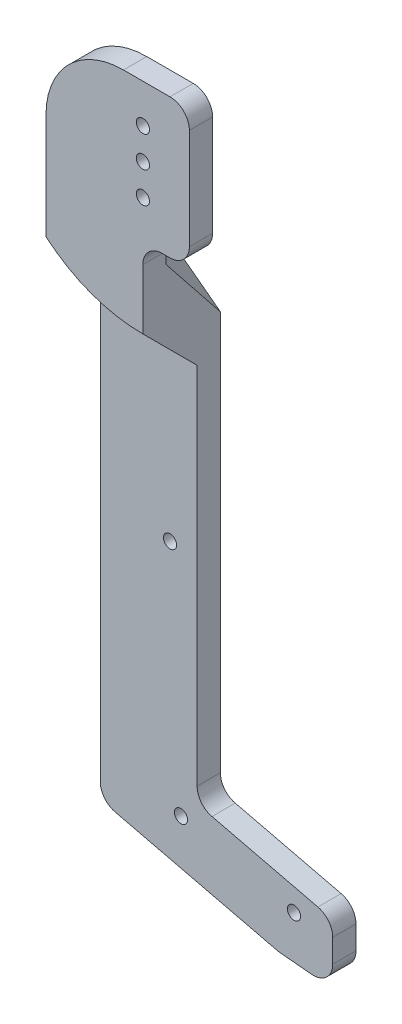
ISO-10303-21;
HEADER;
FILE_DESCRIPTION(('STEP AP214'),'2;1');
FILE_NAME('part.step','',(''),(''),'','','');
FILE_SCHEMA(('AUTOMOTIVE_DESIGN { 1 0 10303 214 1 1 1 1 }'));
ENDSEC;
DATA;
#1=APPLICATION_CONTEXT('core data for automotive mechanical design processes');
#2=APPLICATION_PROTOCOL_DEFINITION('international standard','automotive_design',2000,#1);
#3=PRODUCT_CONTEXT('',#1,'mechanical');
#4=PRODUCT('Part','Part','',(#3));
#5=PRODUCT_RELATED_PRODUCT_CATEGORY('part','',(#4));
#6=PRODUCT_DEFINITION_FORMATION('','',#4);
#7=PRODUCT_DEFINITION_CONTEXT('part definition',#1,'design');
#8=PRODUCT_DEFINITION('design','',#6,#7);
#9=PRODUCT_DEFINITION_SHAPE('','',#8);
#10=(LENGTH_UNIT() NAMED_UNIT(*) SI_UNIT(.MILLI.,.METRE.));
#11=(NAMED_UNIT(*) PLANE_ANGLE_UNIT() SI_UNIT($,.RADIAN.));
#12=(NAMED_UNIT(*) SI_UNIT($,.STERADIAN.) SOLID_ANGLE_UNIT());
#13=UNCERTAINTY_MEASURE_WITH_UNIT(LENGTH_MEASURE(1.E-05),#10,'distance_accuracy_value','');
#14=(GEOMETRIC_REPRESENTATION_CONTEXT(3) GLOBAL_UNCERTAINTY_ASSIGNED_CONTEXT((#13)) GLOBAL_UNIT_ASSIGNED_CONTEXT((#10,
#11,#12)) REPRESENTATION_CONTEXT('',''));
#15=CARTESIAN_POINT('',(0.,0.,0.));
#16=DIRECTION('',(0.,0.,1.));
#17=DIRECTION('',(1.,0.,0.));
#18=AXIS2_PLACEMENT_3D('',#15,#16,#17);
#19=CARTESIAN_POINT('',(-91.8,168.343206378851,20.));
#20=DIRECTION('',(0.,0.,-1.));
#21=DIRECTION('',(1.,0.,0.));
#22=AXIS2_PLACEMENT_3D('',#19,#20,#21);
#23=PLANE('',#22);
#24=CARTESIAN_POINT('',(-91.8,176.343206378851,20.));
#25=DIRECTION('',(0.,0.,1.));
#26=DIRECTION('',(1.,0.,0.));
#27=AXIS2_PLACEMENT_3D('',#24,#25,#26);
#28=CIRCLE('',#27,1.70000000000001);
#29=CARTESIAN_POINT('',(-90.1,176.343206378851,20.));
#30=VERTEX_POINT('',#29);
#31=EDGE_CURVE('E210',#30,#30,#28,.T.);
#32=ORIENTED_EDGE('',*,*,#31,.T.);
#33=EDGE_LOOP('',(#32));
#34=FACE_BOUND('',#33,.T.);
#35=CARTESIAN_POINT('',(-91.8,168.343206378851,20.));
#36=DIRECTION('',(0.,0.,1.));
#37=DIRECTION('',(1.,0.,0.));
#38=AXIS2_PLACEMENT_3D('',#35,#36,#37);
#39=CIRCLE('',#38,1.70000000000001);
#40=CARTESIAN_POINT('',(-90.1,168.343206378851,20.));
#41=VERTEX_POINT('',#40);
#42=EDGE_CURVE('E544',#41,#41,#39,.T.);
#43=ORIENTED_EDGE('',*,*,#42,.T.);
#44=EDGE_LOOP('',(#43));
#45=FACE_BOUND('',#44,.T.);
#46=CARTESIAN_POINT('',(-91.8,160.343206378851,20.));
#47=DIRECTION('',(0.,0.,1.));
#48=DIRECTION('',(1.,0.,0.));
#49=AXIS2_PLACEMENT_3D('',#46,#47,#48);
#50=CIRCLE('',#49,1.70000000000001);
#51=CARTESIAN_POINT('',(-90.0999999999999,160.343206378851,20.));
#52=VERTEX_POINT('',#51);
#53=EDGE_CURVE('E541',#52,#52,#50,.T.);
#54=ORIENTED_EDGE('',*,*,#53,.T.);
#55=EDGE_LOOP('',(#54));
#56=FACE_BOUND('',#55,.T.);
#57=DIRECTION('',(0.,1.,0.));
#58=VECTOR('',#57,1.);
#59=CARTESIAN_POINT('',(-116.8,0.,20.));
#60=LINE('',#59,#58);
#61=CARTESIAN_POINT('',(-116.8,161.201777950308,20.));
#62=VERTEX_POINT('',#61);
#63=CARTESIAN_POINT('',(-116.8,166.343206378851,20.));
#64=VERTEX_POINT('',#63);
#65=EDGE_CURVE('E206',#62,#64,#60,.T.);
#66=ORIENTED_EDGE('',*,*,#65,.T.);
#67=CARTESIAN_POINT('',(-96.8,166.343206378851,20.));
#68=DIRECTION('',(0.,0.,1.));
#69=DIRECTION('',(1.,0.,0.));
#70=AXIS2_PLACEMENT_3D('',#67,#68,#69);
#71=CIRCLE('',#70,20.);
#72=CARTESIAN_POINT('',(-96.8,186.343206378851,20.));
#73=VERTEX_POINT('',#72);
#74=EDGE_CURVE('E223',#64,#73,#71,.F.);
#75=ORIENTED_EDGE('',*,*,#74,.T.);
#76=DIRECTION('',(-1.,0.,0.));
#77=VECTOR('',#76,1.);
#78=CARTESIAN_POINT('',(0.,186.343206378851,20.));
#79=LINE('',#78,#77);
#80=CARTESIAN_POINT('',(-84.8,186.343206378851,20.));
#81=VERTEX_POINT('',#80);
#82=EDGE_CURVE('E539',#81,#73,#79,.T.);
#83=ORIENTED_EDGE('',*,*,#82,.F.);
#84=CARTESIAN_POINT('',(-84.8,181.343206378851,20.));
#85=DIRECTION('',(0.,0.,1.));
#86=DIRECTION('',(1.,0.,0.));
#87=AXIS2_PLACEMENT_3D('',#84,#85,#86);
#88=CIRCLE('',#87,5.);
#89=CARTESIAN_POINT('',(-79.8,181.343206378851,20.));
#90=VERTEX_POINT('',#89);
#91=EDGE_CURVE('E329',#81,#90,#88,.F.);
#92=ORIENTED_EDGE('',*,*,#91,.T.);
#93=DIRECTION('',(0.,-1.,0.));
#94=VECTOR('',#93,1.);
#95=CARTESIAN_POINT('',(-79.8,0.,20.));
#96=LINE('',#95,#94);
#97=CARTESIAN_POINT('',(-79.8,155.343206378851,20.));
#98=VERTEX_POINT('',#97);
#99=EDGE_CURVE('E534',#90,#98,#96,.T.);
#100=ORIENTED_EDGE('',*,*,#99,.T.);
#101=CARTESIAN_POINT('',(-84.8,155.343206378851,20.));
#102=DIRECTION('',(0.,0.,1.));
#103=DIRECTION('',(1.,0.,0.));
#104=AXIS2_PLACEMENT_3D('',#101,#102,#103);
#105=CIRCLE('',#104,5.);
#106=CARTESIAN_POINT('',(-84.8,150.343206378851,20.));
#107=VERTEX_POINT('',#106);
#108=EDGE_CURVE('E533',#98,#107,#105,.F.);
#109=ORIENTED_EDGE('',*,*,#108,.T.);
#110=DIRECTION('',(1.,0.,0.));
#111=VECTOR('',#110,1.);
#112=CARTESIAN_POINT('',(0.,150.343206378851,20.));
#113=LINE('',#112,#111);
#114=CARTESIAN_POINT('',(-86.8,150.343206378851,20.));
#115=VERTEX_POINT('',#114);
#116=EDGE_CURVE('E218',#115,#107,#113,.T.);
#117=ORIENTED_EDGE('',*,*,#116,.F.);
#118=CARTESIAN_POINT('',(-86.8,145.343206378851,20.));
#119=DIRECTION('',(0.,0.,1.));
#120=DIRECTION('',(1.,0.,0.));
#121=AXIS2_PLACEMENT_3D('',#118,#119,#120);
#122=CIRCLE('',#121,5.);
#123=CARTESIAN_POINT('',(-91.8,145.343206378851,20.));
#124=VERTEX_POINT('',#123);
#125=EDGE_CURVE('E217',#124,#115,#122,.F.);
#126=ORIENTED_EDGE('',*,*,#125,.F.);
#127=DIRECTION('',(0.,-1.,0.));
#128=VECTOR('',#127,1.);
#129=CARTESIAN_POINT('',(-91.8,0.,20.));
#130=LINE('',#129,#128);
#131=CARTESIAN_POINT('',(-91.8,142.343206378851,20.));
#132=VERTEX_POINT('',#131);
#133=EDGE_CURVE('E209',#124,#132,#130,.T.);
#134=ORIENTED_EDGE('',*,*,#133,.T.);
#135=DIRECTION('',(-0.79833273895498,0.602216603816799,0.));
#136=VECTOR('',#135,1.);
#137=CARTESIAN_POINT('',(35.1416017156057,46.5857151248841,20.));
#138=LINE('',#137,#136);
#139=EDGE_CURVE('E194',#132,#62,#138,.T.);
#140=ORIENTED_EDGE('',*,*,#139,.T.);
#141=EDGE_LOOP('',(#66,#75,#83,#92,#100,#109,#117,#126,#134,#140));
#142=FACE_BOUND('',#141,.T.);
#143=ADVANCED_FACE('F41',(#34,#45,#56,#142),#23,.T.);
#144=CARTESIAN_POINT('',(-79.8,0.,6.));
#145=DIRECTION('',(1.,0.,0.));
#146=DIRECTION('',(0.,0.,1.));
#147=AXIS2_PLACEMENT_3D('',#144,#145,#146);
#148=PLANE('',#147);
#149=DIRECTION('',(0.,0.,1.));
#150=VECTOR('',#149,1.);
#151=CARTESIAN_POINT('',(-79.8,181.343206378851,6.));
#152=LINE('',#151,#150);
#153=CARTESIAN_POINT('',(-79.8,181.343206378851,26.));
#154=VERTEX_POINT('',#153);
#155=EDGE_CURVE('E321',#154,#90,#152,.F.);
#156=ORIENTED_EDGE('',*,*,#155,.F.);
#157=DIRECTION('',(0.,1.,0.));
#158=VECTOR('',#157,1.);
#159=CARTESIAN_POINT('',(-79.8,0.,26.));
#160=LINE('',#159,#158);
#161=CARTESIAN_POINT('',(-79.8,155.343206378851,26.));
#162=VERTEX_POINT('',#161);
#163=EDGE_CURVE('E249',#162,#154,#160,.T.);
#164=ORIENTED_EDGE('',*,*,#163,.F.);
#165=DIRECTION('',(0.,0.,1.));
#166=VECTOR('',#165,1.);
#167=CARTESIAN_POINT('',(-79.8,155.343206378851,12.));
#168=LINE('',#167,#166);
#169=EDGE_CURVE('E323',#98,#162,#168,.T.);
#170=ORIENTED_EDGE('',*,*,#169,.F.);
#171=ORIENTED_EDGE('',*,*,#99,.F.);
#172=EDGE_LOOP('',(#156,#164,#170,#171));
#173=FACE_BOUND('',#172,.T.);
#174=ADVANCED_FACE('F380',(#173),#148,.T.);
#175=CARTESIAN_POINT('',(0.,186.343206378851,6.));
#176=DIRECTION('',(0.,-1.,0.));
#177=DIRECTION('',(0.,0.,1.));
#178=AXIS2_PLACEMENT_3D('',#175,#176,#177);
#179=PLANE('',#178);
#180=ORIENTED_EDGE('',*,*,#82,.T.);
#181=DIRECTION('',(0.,0.,1.));
#182=VECTOR('',#181,1.);
#183=CARTESIAN_POINT('',(-96.8,186.343206378851,6.));
#184=LINE('',#183,#182);
#185=CARTESIAN_POINT('',(-96.8,186.343206378851,26.));
#186=VERTEX_POINT('',#185);
#187=EDGE_CURVE('E312',#186,#73,#184,.F.);
#188=ORIENTED_EDGE('',*,*,#187,.F.);
#189=DIRECTION('',(-1.,0.,0.));
#190=VECTOR('',#189,1.);
#191=CARTESIAN_POINT('',(0.,186.343206378851,26.));
#192=LINE('',#191,#190);
#193=CARTESIAN_POINT('',(-84.8,186.343206378851,26.));
#194=VERTEX_POINT('',#193);
#195=EDGE_CURVE('E254',#194,#186,#192,.T.);
#196=ORIENTED_EDGE('',*,*,#195,.F.);
#197=DIRECTION('',(0.,0.,1.));
#198=VECTOR('',#197,1.);
#199=CARTESIAN_POINT('',(-84.8,186.343206378851,12.));
#200=LINE('',#199,#198);
#201=EDGE_CURVE('E326',#81,#194,#200,.T.);
#202=ORIENTED_EDGE('',*,*,#201,.F.);
#203=EDGE_LOOP('',(#180,#188,#196,#202));
#204=FACE_BOUND('',#203,.T.);
#205=ADVANCED_FACE('F386',(#204),#179,.F.);
#206=CARTESIAN_POINT('',(-91.8,160.343206378851,6.));
#207=DIRECTION('',(0.,0.,1.));
#208=DIRECTION('',(-1.,0.,0.));
#209=AXIS2_PLACEMENT_3D('',#206,#207,#208);
#210=CYLINDRICAL_SURFACE('',#209,1.70000000000001);
#211=CARTESIAN_POINT('',(-91.8,160.343206378851,26.));
#212=DIRECTION('',(0.,0.,1.));
#213=DIRECTION('',(1.,0.,0.));
#214=AXIS2_PLACEMENT_3D('',#211,#212,#213);
#215=CIRCLE('',#214,1.70000000000001);
#216=CARTESIAN_POINT('',(-90.0999999999999,160.343206378851,26.));
#217=VERTEX_POINT('',#216);
#218=EDGE_CURVE('E231',#217,#217,#215,.F.);
#219=ORIENTED_EDGE('',*,*,#218,.F.);
#220=EDGE_LOOP('',(#219));
#221=FACE_BOUND('',#220,.T.);
#222=ORIENTED_EDGE('',*,*,#53,.F.);
#223=EDGE_LOOP('',(#222));
#224=FACE_BOUND('',#223,.T.);
#225=ADVANCED_FACE('F415',(#221,#224),#210,.F.);
#226=CARTESIAN_POINT('',(-91.8,168.343206378851,6.));
#227=DIRECTION('',(0.,0.,1.));
#228=DIRECTION('',(-1.,0.,0.));
#229=AXIS2_PLACEMENT_3D('',#226,#227,#228);
#230=CYLINDRICAL_SURFACE('',#229,1.70000000000001);
#231=CARTESIAN_POINT('',(-91.8,168.343206378851,26.));
#232=DIRECTION('',(0.,0.,1.));
#233=DIRECTION('',(1.,0.,0.));
#234=AXIS2_PLACEMENT_3D('',#231,#232,#233);
#235=CIRCLE('',#234,1.70000000000001);
#236=CARTESIAN_POINT('',(-90.1,168.343206378851,26.));
#237=VERTEX_POINT('',#236);
#238=EDGE_CURVE('E228',#237,#237,#235,.F.);
#239=ORIENTED_EDGE('',*,*,#238,.F.);
#240=EDGE_LOOP('',(#239));
#241=FACE_BOUND('',#240,.T.);
#242=ORIENTED_EDGE('',*,*,#42,.F.);
#243=EDGE_LOOP('',(#242));
#244=FACE_BOUND('',#243,.T.);
#245=ADVANCED_FACE('F418',(#241,#244),#230,.F.);
#246=CARTESIAN_POINT('',(-91.8,176.343206378851,6.));
#247=DIRECTION('',(0.,0.,1.));
#248=DIRECTION('',(-1.,0.,0.));
#249=AXIS2_PLACEMENT_3D('',#246,#247,#248);
#250=CYLINDRICAL_SURFACE('',#249,1.70000000000001);
#251=CARTESIAN_POINT('',(-91.8,176.343206378851,26.));
#252=DIRECTION('',(0.,0.,1.));
#253=DIRECTION('',(1.,0.,0.));
#254=AXIS2_PLACEMENT_3D('',#251,#252,#253);
#255=CIRCLE('',#254,1.70000000000001);
#256=CARTESIAN_POINT('',(-90.1,176.343206378851,26.));
#257=VERTEX_POINT('',#256);
#258=EDGE_CURVE('E234',#257,#257,#255,.F.);
#259=ORIENTED_EDGE('',*,*,#258,.F.);
#260=EDGE_LOOP('',(#259));
#261=FACE_BOUND('',#260,.T.);
#262=ORIENTED_EDGE('',*,*,#31,.F.);
#263=EDGE_LOOP('',(#262));
#264=FACE_BOUND('',#263,.T.);
#265=ADVANCED_FACE('F422',(#261,#264),#250,.F.);
#266=CARTESIAN_POINT('',(0.,150.343206378851,6.));
#267=DIRECTION('',(0.,1.,0.));
#268=DIRECTION('',(0.,0.,-1.));
#269=AXIS2_PLACEMENT_3D('',#266,#267,#268);
#270=PLANE('',#269);
#271=ORIENTED_EDGE('',*,*,#116,.T.);
#272=DIRECTION('',(0.,0.,1.));
#273=VECTOR('',#272,1.);
#274=CARTESIAN_POINT('',(-84.8,150.343206378851,6.));
#275=LINE('',#274,#273);
#276=CARTESIAN_POINT('',(-84.8,150.343206378851,26.));
#277=VERTEX_POINT('',#276);
#278=EDGE_CURVE('E314',#277,#107,#275,.F.);
#279=ORIENTED_EDGE('',*,*,#278,.F.);
#280=DIRECTION('',(1.,0.,0.));
#281=VECTOR('',#280,1.);
#282=CARTESIAN_POINT('',(0.,150.343206378851,26.));
#283=LINE('',#282,#281);
#284=CARTESIAN_POINT('',(-86.8,150.343206378851,26.));
#285=VERTEX_POINT('',#284);
#286=EDGE_CURVE('E244',#285,#277,#283,.T.);
#287=ORIENTED_EDGE('',*,*,#286,.F.);
#288=DIRECTION('',(0.,0.,1.));
#289=VECTOR('',#288,1.);
#290=CARTESIAN_POINT('',(-86.8,150.343206378851,6.));
#291=LINE('',#290,#289);
#292=EDGE_CURVE('E316',#115,#285,#291,.T.);
#293=ORIENTED_EDGE('',*,*,#292,.F.);
#294=EDGE_LOOP('',(#271,#279,#287,#293));
#295=FACE_BOUND('',#294,.T.);
#296=ADVANCED_FACE('F426',(#295),#270,.F.);
#297=CARTESIAN_POINT('',(-96.8,166.343206378851,6.));
#298=DIRECTION('',(0.,0.,-1.));
#299=DIRECTION('',(1.,0.,0.));
#300=AXIS2_PLACEMENT_3D('',#297,#298,#299);
#301=CYLINDRICAL_SURFACE('',#300,20.);
#302=DIRECTION('',(0.,0.,1.));
#303=VECTOR('',#302,1.);
#304=CARTESIAN_POINT('',(-116.8,166.343206378851,12.));
#305=LINE('',#304,#303);
#306=CARTESIAN_POINT('',(-116.8,166.343206378851,26.));
#307=VERTEX_POINT('',#306);
#308=EDGE_CURVE('E215',#64,#307,#305,.T.);
#309=ORIENTED_EDGE('',*,*,#308,.T.);
#310=CARTESIAN_POINT('',(-96.8,166.343206378851,26.));
#311=DIRECTION('',(0.,0.,1.));
#312=DIRECTION('',(1.,0.,0.));
#313=AXIS2_PLACEMENT_3D('',#310,#311,#312);
#314=CIRCLE('',#313,20.);
#315=EDGE_CURVE('E257',#186,#307,#314,.T.);
#316=ORIENTED_EDGE('',*,*,#315,.F.);
#317=ORIENTED_EDGE('',*,*,#187,.T.);
#318=ORIENTED_EDGE('',*,*,#74,.F.);
#319=EDGE_LOOP('',(#309,#316,#317,#318));
#320=FACE_BOUND('',#319,.T.);
#321=ADVANCED_FACE('F430',(#320),#301,.T.);
#322=CARTESIAN_POINT('',(-86.8,145.343206378851,6.));
#323=DIRECTION('',(0.,0.,1.));
#324=DIRECTION('',(-1.,0.,0.));
#325=AXIS2_PLACEMENT_3D('',#322,#323,#324);
#326=CYLINDRICAL_SURFACE('',#325,5.);
#327=ORIENTED_EDGE('',*,*,#125,.T.);
#328=ORIENTED_EDGE('',*,*,#292,.T.);
#329=CARTESIAN_POINT('',(-86.8,145.343206378851,26.));
#330=DIRECTION('',(0.,0.,1.));
#331=DIRECTION('',(1.,0.,0.));
#332=AXIS2_PLACEMENT_3D('',#329,#330,#331);
#333=CIRCLE('',#332,5.);
#334=CARTESIAN_POINT('',(-91.8,145.343206378851,26.));
#335=VERTEX_POINT('',#334);
#336=EDGE_CURVE('E242',#335,#285,#333,.F.);
#337=ORIENTED_EDGE('',*,*,#336,.F.);
#338=DIRECTION('',(0.,0.,1.));
#339=VECTOR('',#338,1.);
#340=CARTESIAN_POINT('',(-91.8,145.343206378851,6.));
#341=LINE('',#340,#339);
#342=EDGE_CURVE('E319',#335,#124,#341,.F.);
#343=ORIENTED_EDGE('',*,*,#342,.T.);
#344=EDGE_LOOP('',(#327,#328,#337,#343));
#345=FACE_BOUND('',#344,.T.);
#346=ADVANCED_FACE('F524',(#345),#326,.F.);
#347=CARTESIAN_POINT('',(-84.8,155.343206378851,6.));
#348=DIRECTION('',(0.,0.,-1.));
#349=DIRECTION('',(1.,0.,0.));
#350=AXIS2_PLACEMENT_3D('',#347,#348,#349);
#351=CYLINDRICAL_SURFACE('',#350,5.);
#352=ORIENTED_EDGE('',*,*,#169,.T.);
#353=CARTESIAN_POINT('',(-84.8,155.343206378851,26.));
#354=DIRECTION('',(0.,0.,1.));
#355=DIRECTION('',(1.,0.,0.));
#356=AXIS2_PLACEMENT_3D('',#353,#354,#355);
#357=CIRCLE('',#356,5.);
#358=EDGE_CURVE('E247',#277,#162,#357,.T.);
#359=ORIENTED_EDGE('',*,*,#358,.F.);
#360=ORIENTED_EDGE('',*,*,#278,.T.);
#361=ORIENTED_EDGE('',*,*,#108,.F.);
#362=EDGE_LOOP('',(#352,#359,#360,#361));
#363=FACE_BOUND('',#362,.T.);
#364=ADVANCED_FACE('F562',(#363),#351,.T.);
#365=CARTESIAN_POINT('',(-84.8,181.343206378851,6.));
#366=DIRECTION('',(0.,0.,-1.));
#367=DIRECTION('',(1.,0.,0.));
#368=AXIS2_PLACEMENT_3D('',#365,#366,#367);
#369=CYLINDRICAL_SURFACE('',#368,5.);
#370=ORIENTED_EDGE('',*,*,#201,.T.);
#371=CARTESIAN_POINT('',(-84.8,181.343206378851,26.));
#372=DIRECTION('',(0.,0.,1.));
#373=DIRECTION('',(1.,0.,0.));
#374=AXIS2_PLACEMENT_3D('',#371,#372,#373);
#375=CIRCLE('',#374,5.);
#376=EDGE_CURVE('E252',#154,#194,#375,.T.);
#377=ORIENTED_EDGE('',*,*,#376,.F.);
#378=ORIENTED_EDGE('',*,*,#155,.T.);
#379=ORIENTED_EDGE('',*,*,#91,.F.);
#380=EDGE_LOOP('',(#370,#377,#378,#379));
#381=FACE_BOUND('',#380,.T.);
#382=ADVANCED_FACE('F358',(#381),#369,.T.);
#383=CARTESIAN_POINT('',(-116.8,0.,6.));
#384=DIRECTION('',(-1.,0.,0.));
#385=DIRECTION('',(0.,0.,-1.));
#386=AXIS2_PLACEMENT_3D('',#383,#384,#385);
#387=PLANE('',#386);
#388=DIRECTION('',(0.,1.,0.));
#389=VECTOR('',#388,1.);
#390=CARTESIAN_POINT('',(-116.8,0.,12.));
#391=LINE('',#390,#389);
#392=CARTESIAN_POINT('',(-116.8,10.2851904317238,12.));
#393=VERTEX_POINT('',#392);
#394=CARTESIAN_POINT('',(-116.8,122.177743097302,12.));
#395=VERTEX_POINT('',#394);
#396=EDGE_CURVE('E260',#393,#395,#391,.T.);
#397=ORIENTED_EDGE('',*,*,#396,.T.);
#398=CARTESIAN_POINT('',(-116.8,139.064374434936,26.));
#399=CARTESIAN_POINT('',(-116.8,138.700457591178,25.7232404987831));
#400=CARTESIAN_POINT('',(-116.8,138.337586577493,25.4451105847748));
#401=CARTESIAN_POINT('',(-116.8,137.613800612838,24.8863230709105));
#402=CARTESIAN_POINT('',(-116.8,137.252885645053,24.6056654928386));
#403=CARTESIAN_POINT('',(-116.8,136.172896898765,23.7602410622729));
#404=CARTESIAN_POINT('',(-116.8,135.456544074135,23.191995680082));
#405=CARTESIAN_POINT('',(-116.8,134.030375744549,22.0477998598504));
#406=CARTESIAN_POINT('',(-116.8,133.32055838123,21.4718517339912));
#407=CARTESIAN_POINT('',(-116.8,131.906446473543,20.3132012796707));
#408=CARTESIAN_POINT('',(-116.8,131.202152000253,19.7304988645201));
#409=CARTESIAN_POINT('',(-116.8,129.79852480176,18.5593549160808));
#410=CARTESIAN_POINT('',(-116.8,129.099191385901,17.970914209854));
#411=CARTESIAN_POINT('',(-116.8,127.704816864184,16.7889746382706));
#412=CARTESIAN_POINT('',(-116.8,127.009775750277,16.1954757824045));
#413=CARTESIAN_POINT('',(-116.8,125.623284992167,15.0038801251373));
#414=CARTESIAN_POINT('',(-116.8,124.931836492278,14.4057819931989));
#415=CARTESIAN_POINT('',(-116.8,123.552341574005,13.2056870748378));
#416=CARTESIAN_POINT('',(-116.8,122.864295124071,12.603690324691));
#417=CARTESIAN_POINT('',(-116.8,122.177743097302,12.));
#418=B_SPLINE_CURVE_WITH_KNOTS('',3,(#398,#399,#400,#401,#402,#403,#404,#405,#406,#407,#408,
#409,#410,#411,#412,#413,#414,#415,#416,#417),.UNSPECIFIED.,.F.,.F.,(4,2,2,2,2,2,2,2,2,4),(0.,
1.37159023815598,2.74316866692933,5.48619274357092,8.22841112922936,10.9706647495671,
13.7125288039228,16.4543877149276,19.197072137035,21.9397310754558),.UNSPECIFIED.);
#419=CARTESIAN_POINT('',(-116.8,139.064374434936,26.));
#420=VERTEX_POINT('',#419);
#421=EDGE_CURVE('E339',#420,#395,#418,.T.);
#422=ORIENTED_EDGE('',*,*,#421,.F.);
#423=DIRECTION('',(0.,-1.,0.));
#424=VECTOR('',#423,1.);
#425=CARTESIAN_POINT('',(-116.8,0.,26.));
#426=LINE('',#425,#424);
#427=EDGE_CURVE('E237',#307,#420,#426,.T.);
#428=ORIENTED_EDGE('',*,*,#427,.F.);
#429=ORIENTED_EDGE('',*,*,#308,.F.);
#430=ORIENTED_EDGE('',*,*,#65,.F.);
#431=DIRECTION('',(0.,0.781504000960084,0.623900229590742));
#432=VECTOR('',#431,1.);
#433=CARTESIAN_POINT('',(-116.8,55.9219059441879,-64.0483685754759));
#434=LINE('',#433,#432);
#435=CARTESIAN_POINT('',(-116.8,143.665230447163,6.));
#436=VERTEX_POINT('',#435);
#437=EDGE_CURVE('E190',#436,#62,#434,.T.);
#438=ORIENTED_EDGE('',*,*,#437,.F.);
#439=DIRECTION('',(0.,1.,0.));
#440=VECTOR('',#439,1.);
#441=CARTESIAN_POINT('',(-116.8,0.,6.));
#442=LINE('',#441,#440);
#443=CARTESIAN_POINT('',(-116.8,10.2851904317238,6.));
#444=VERTEX_POINT('',#443);
#445=EDGE_CURVE('E261',#444,#436,#442,.T.);
#446=ORIENTED_EDGE('',*,*,#445,.F.);
#447=DIRECTION('',(0.,0.,1.));
#448=VECTOR('',#447,1.);
#449=CARTESIAN_POINT('',(-116.8,10.2851904317238,6.));
#450=LINE('',#449,#448);
#451=EDGE_CURVE('E472',#393,#444,#450,.F.);
#452=ORIENTED_EDGE('',*,*,#451,.F.);
#453=EDGE_LOOP('',(#397,#422,#428,#429,#430,#438,#446,#452));
#454=FACE_BOUND('',#453,.T.);
#455=ADVANCED_FACE('F213',(#454),#387,.T.);
#456=CARTESIAN_POINT('',(-4.92181398361935,-20.5075582650806,6.));
#457=DIRECTION('',(-0.233372952475324,-0.972387301980517,0.));
#458=DIRECTION('',(0.972387301980517,-0.233372952475325,0.));
#459=AXIS2_PLACEMENT_3D('',#456,#457,#458);
#460=PLANE('',#459);
#461=DIRECTION('',(-0.972387301980517,0.233372952475325,0.));
#462=VECTOR('',#461,1.);
#463=CARTESIAN_POINT('',(-4.92181398361935,-20.5075582650806,12.));
#464=LINE('',#463,#462);
#465=CARTESIAN_POINT('',(-71.1017199813971,-4.62438082561388,12.));
#466=VERTEX_POINT('',#465);
#467=CARTESIAN_POINT('',(-112.966864762377,5.42325392182121,12.));
#468=VERTEX_POINT('',#467);
#469=EDGE_CURVE('E288',#466,#468,#464,.T.);
#470=ORIENTED_EDGE('',*,*,#469,.T.);
#471=DIRECTION('',(0.,0.,1.));
#472=VECTOR('',#471,1.);
#473=CARTESIAN_POINT('',(-112.966864762377,5.42325392182121,6.));
#474=LINE('',#473,#472);
#475=CARTESIAN_POINT('',(-112.966864762377,5.42325392182121,6.));
#476=VERTEX_POINT('',#475);
#477=EDGE_CURVE('E457',#476,#468,#474,.T.);
#478=ORIENTED_EDGE('',*,*,#477,.F.);
#479=DIRECTION('',(-0.972387301980517,0.233372952475325,0.));
#480=VECTOR('',#479,1.);
#481=CARTESIAN_POINT('',(-4.92181398361935,-20.5075582650806,6.));
#482=LINE('',#481,#480);
#483=CARTESIAN_POINT('',(-71.1017199813971,-4.62438082561388,6.));
#484=VERTEX_POINT('',#483);
#485=EDGE_CURVE('E263',#484,#476,#482,.T.);
#486=ORIENTED_EDGE('',*,*,#485,.F.);
#487=DIRECTION('',(0.,0.,1.));
#488=VECTOR('',#487,1.);
#489=CARTESIAN_POINT('',(-71.1017199813971,-4.62438082561389,6.));
#490=LINE('',#489,#488);
#491=EDGE_CURVE('E458',#466,#484,#490,.F.);
#492=ORIENTED_EDGE('',*,*,#491,.F.);
#493=EDGE_LOOP('',(#470,#478,#486,#492));
#494=FACE_BOUND('',#493,.T.);
#495=ADVANCED_FACE('F445',(#494),#460,.T.);
#496=CARTESIAN_POINT('',(-1.03363541910885,-11.1634606403012,6.));
#497=DIRECTION('',(-0.092196588260455,-0.995740824267606,0.));
#498=DIRECTION('',(0.995740824267606,-0.092196588260455,0.));
#499=AXIS2_PLACEMENT_3D('',#496,#497,#498);
#500=PLANE('',#499);
#501=DIRECTION('',(-0.995740824267606,0.092196588260455,0.));
#502=VECTOR('',#501,1.);
#503=CARTESIAN_POINT('',(-1.03363541910885,-11.1634606403012,12.));
#504=LINE('',#503,#502);
#505=CARTESIAN_POINT('',(-62.2609829413023,-5.4943624048889,12.));
#506=VERTEX_POINT('',#505);
#507=CARTESIAN_POINT('',(-70.3958381603228,-4.74114843704933,12.));
#508=VERTEX_POINT('',#507);
#509=EDGE_CURVE('E291',#506,#508,#504,.T.);
#510=ORIENTED_EDGE('',*,*,#509,.T.);
#511=DIRECTION('',(0.,0.,1.));
#512=VECTOR('',#511,1.);
#513=CARTESIAN_POINT('',(-70.3958381603228,-4.74114843704933,6.));
#514=LINE('',#513,#512);
#515=CARTESIAN_POINT('',(-70.3958381603228,-4.74114843704933,6.));
#516=VERTEX_POINT('',#515);
#517=EDGE_CURVE('E474',#516,#508,#514,.T.);
#518=ORIENTED_EDGE('',*,*,#517,.F.);
#519=DIRECTION('',(-0.995740824267606,0.092196588260455,0.));
#520=VECTOR('',#519,1.);
#521=CARTESIAN_POINT('',(-1.03363541910885,-11.1634606403012,6.));
#522=LINE('',#521,#520);
#523=CARTESIAN_POINT('',(-62.2609829413023,-5.4943624048889,6.));
#524=VERTEX_POINT('',#523);
#525=EDGE_CURVE('E267',#524,#516,#522,.T.);
#526=ORIENTED_EDGE('',*,*,#525,.F.);
#527=DIRECTION('',(0.,0.,1.));
#528=VECTOR('',#527,1.);
#529=CARTESIAN_POINT('',(-62.2609829413023,-5.4943624048889,6.));
#530=LINE('',#529,#528);
#531=EDGE_CURVE('E470',#506,#524,#530,.F.);
#532=ORIENTED_EDGE('',*,*,#531,.F.);
#533=EDGE_LOOP('',(#510,#518,#526,#532));
#534=FACE_BOUND('',#533,.T.);
#535=ADVANCED_FACE('F442',(#534),#500,.T.);
#536=CARTESIAN_POINT('',(-56.8,0.,6.));
#537=DIRECTION('',(-1.,0.,0.));
#538=DIRECTION('',(0.,-1.,0.));
#539=AXIS2_PLACEMENT_3D('',#536,#537,#538);
#540=PLANE('',#539);
#541=DIRECTION('',(0.,1.,0.));
#542=VECTOR('',#541,1.);
#543=CARTESIAN_POINT('',(-56.8,0.,12.));
#544=LINE('',#543,#542);
#545=CARTESIAN_POINT('',(-56.8,-0.515658283550868,12.));
#546=VERTEX_POINT('',#545);
#547=CARTESIAN_POINT('',(-56.8,5.48396810574596,12.));
#548=VERTEX_POINT('',#547);
#549=EDGE_CURVE('E294',#546,#548,#544,.T.);
#550=ORIENTED_EDGE('',*,*,#549,.F.);
#551=DIRECTION('',(0.,0.,1.));
#552=VECTOR('',#551,1.);
#553=CARTESIAN_POINT('',(-56.8,-0.515658283550868,12.));
#554=LINE('',#553,#552);
#555=CARTESIAN_POINT('',(-56.8,-0.515658283550868,6.));
#556=VERTEX_POINT('',#555);
#557=EDGE_CURVE('E498',#556,#546,#554,.T.);
#558=ORIENTED_EDGE('',*,*,#557,.F.);
#559=DIRECTION('',(0.,1.,0.));
#560=VECTOR('',#559,1.);
#561=CARTESIAN_POINT('',(-56.8,0.,6.));
#562=LINE('',#561,#560);
#563=CARTESIAN_POINT('',(-56.8,5.48396810574596,6.));
#564=VERTEX_POINT('',#563);
#565=EDGE_CURVE('E269',#556,#564,#562,.T.);
#566=ORIENTED_EDGE('',*,*,#565,.T.);
#567=DIRECTION('',(0.,0.,1.));
#568=VECTOR('',#567,1.);
#569=CARTESIAN_POINT('',(-56.8,5.48396810574596,6.));
#570=LINE('',#569,#568);
#571=EDGE_CURVE('E501',#548,#564,#570,.F.);
#572=ORIENTED_EDGE('',*,*,#571,.F.);
#573=EDGE_LOOP('',(#550,#558,#566,#572));
#574=FACE_BOUND('',#573,.T.);
#575=ADVANCED_FACE('F438',(#574),#540,.F.);
#576=CARTESIAN_POINT('',(-0.954473791538822,-3.97697413141176,6.));
#577=DIRECTION('',(0.233372952475324,0.972387301980517,0.));
#578=DIRECTION('',(-0.972387301980518,0.233372952475324,0.));
#579=AXIS2_PLACEMENT_3D('',#576,#577,#578);
#580=PLANE('',#579);
#581=DIRECTION('',(0.972387301980517,-0.233372952475324,0.));
#582=VECTOR('',#581,1.);
#583=CARTESIAN_POINT('',(-0.954473791538822,-3.97697413141176,6.));
#584=LINE('',#583,#582);
#585=CARTESIAN_POINT('',(-87.9668647623766,16.9059997015893,6.));
#586=VERTEX_POINT('',#585);
#587=CARTESIAN_POINT('',(-60.6331352376234,10.3459046156485,6.));
#588=VERTEX_POINT('',#587);
#589=EDGE_CURVE('E272',#586,#588,#584,.T.);
#590=ORIENTED_EDGE('',*,*,#589,.F.);
#591=DIRECTION('',(0.,0.,1.));
#592=VECTOR('',#591,1.);
#593=CARTESIAN_POINT('',(-87.9668647623766,16.9059997015893,6.));
#594=LINE('',#593,#592);
#595=CARTESIAN_POINT('',(-87.9668647623766,16.9059997015893,12.));
#596=VERTEX_POINT('',#595);
#597=EDGE_CURVE('E483',#596,#586,#594,.F.);
#598=ORIENTED_EDGE('',*,*,#597,.F.);
#599=DIRECTION('',(0.972387301980517,-0.233372952475324,0.));
#600=VECTOR('',#599,1.);
#601=CARTESIAN_POINT('',(-0.954473791538822,-3.97697413141176,12.));
#602=LINE('',#601,#600);
#603=CARTESIAN_POINT('',(-60.6331352376234,10.3459046156485,12.));
#604=VERTEX_POINT('',#603);
#605=EDGE_CURVE('E297',#596,#604,#602,.T.);
#606=ORIENTED_EDGE('',*,*,#605,.T.);
#607=DIRECTION('',(0.,0.,1.));
#608=VECTOR('',#607,1.);
#609=CARTESIAN_POINT('',(-60.6331352376234,10.3459046156485,12.));
#610=LINE('',#609,#608);
#611=EDGE_CURVE('E467',#588,#604,#610,.T.);
#612=ORIENTED_EDGE('',*,*,#611,.F.);
#613=EDGE_LOOP('',(#590,#598,#606,#612));
#614=FACE_BOUND('',#613,.T.);
#615=ADVANCED_FACE('F434',(#614),#580,.T.);
#616=CARTESIAN_POINT('',(-91.8,0.,6.));
#617=DIRECTION('',(1.,0.,0.));
#618=DIRECTION('',(0.,1.,0.));
#619=AXIS2_PLACEMENT_3D('',#616,#617,#618);
#620=PLANE('',#619);
#621=DIRECTION('',(0.,-1.,0.));
#622=VECTOR('',#621,1.);
#623=CARTESIAN_POINT('',(-91.8,0.,6.));
#624=LINE('',#623,#622);
#625=CARTESIAN_POINT('',(-91.8,124.806658875706,6.));
#626=VERTEX_POINT('',#625);
#627=CARTESIAN_POINT('',(-91.8,21.7679362114919,6.));
#628=VERTEX_POINT('',#627);
#629=EDGE_CURVE('E275',#626,#628,#624,.T.);
#630=ORIENTED_EDGE('',*,*,#629,.F.);
#631=DIRECTION('',(0.,-0.781504000960084,-0.623900229590742));
#632=VECTOR('',#631,1.);
#633=CARTESIAN_POINT('',(-91.8,48.5811787384592,-54.8532963361266));
#634=LINE('',#633,#632);
#635=EDGE_CURVE('E201',#132,#626,#634,.T.);
#636=ORIENTED_EDGE('',*,*,#635,.F.);
#637=ORIENTED_EDGE('',*,*,#133,.F.);
#638=ORIENTED_EDGE('',*,*,#342,.F.);
#639=DIRECTION('',(0.,1.,0.));
#640=VECTOR('',#639,1.);
#641=CARTESIAN_POINT('',(-91.8,0.,26.));
#642=LINE('',#641,#640);
#643=CARTESIAN_POINT('',(-91.8,129.84320637885,26.));
#644=VERTEX_POINT('',#643);
#645=EDGE_CURVE('E240',#644,#335,#642,.T.);
#646=ORIENTED_EDGE('',*,*,#645,.F.);
#647=DIRECTION('',(0.,0.707106781186551,0.707106781186544));
#648=VECTOR('',#647,1.);
#649=CARTESIAN_POINT('',(-91.8000000000001,168.343206378851,64.4999999999999));
#650=LINE('',#649,#648);
#651=CARTESIAN_POINT('',(-91.8,115.84320637885,12.));
#652=VERTEX_POINT('',#651);
#653=EDGE_CURVE('E334',#652,#644,#650,.T.);
#654=ORIENTED_EDGE('',*,*,#653,.F.);
#655=DIRECTION('',(0.,-1.,0.));
#656=VECTOR('',#655,1.);
#657=CARTESIAN_POINT('',(-91.8,0.,12.));
#658=LINE('',#657,#656);
#659=CARTESIAN_POINT('',(-91.8,21.7679362114919,12.));
#660=VERTEX_POINT('',#659);
#661=EDGE_CURVE('E300',#652,#660,#658,.T.);
#662=ORIENTED_EDGE('',*,*,#661,.T.);
#663=DIRECTION('',(0.,0.,1.));
#664=VECTOR('',#663,1.);
#665=CARTESIAN_POINT('',(-91.8,21.7679362114919,12.));
#666=LINE('',#665,#664);
#667=EDGE_CURVE('E479',#628,#660,#666,.T.);
#668=ORIENTED_EDGE('',*,*,#667,.F.);
#669=EDGE_LOOP('',(#630,#636,#637,#638,#646,#654,#662,#668));
#670=FACE_BOUND('',#669,.T.);
#671=ADVANCED_FACE('F410',(#670),#620,.T.);
#672=CARTESIAN_POINT('',(-95.9716190594155,13.0011885742597,6.));
#673=DIRECTION('',(0.,0.,1.));
#674=DIRECTION('',(-1.,0.,0.));
#675=AXIS2_PLACEMENT_3D('',#672,#673,#674);
#676=CYLINDRICAL_SURFACE('',#675,1.7);
#677=CARTESIAN_POINT('',(-95.9716190594155,13.0011885742597,6.));
#678=DIRECTION('',(0.,0.,1.));
#679=DIRECTION('',(1.,0.,0.));
#680=AXIS2_PLACEMENT_3D('',#677,#678,#679);
#681=CIRCLE('',#680,1.7);
#682=CARTESIAN_POINT('',(-94.2716190594155,13.0011885742597,6.));
#683=VERTEX_POINT('',#682);
#684=EDGE_CURVE('E281',#683,#683,#681,.T.);
#685=ORIENTED_EDGE('',*,*,#684,.F.);
#686=EDGE_LOOP('',(#685));
#687=FACE_BOUND('',#686,.T.);
#688=CARTESIAN_POINT('',(-95.9716190594155,13.0011885742597,12.));
#689=DIRECTION('',(0.,0.,1.));
#690=DIRECTION('',(1.,0.,0.));
#691=AXIS2_PLACEMENT_3D('',#688,#689,#690);
#692=CIRCLE('',#691,1.7);
#693=CARTESIAN_POINT('',(-94.2716190594155,13.0011885742597,12.));
#694=VERTEX_POINT('',#693);
#695=EDGE_CURVE('E306',#694,#694,#692,.T.);
#696=ORIENTED_EDGE('',*,*,#695,.T.);
#697=EDGE_LOOP('',(#696));
#698=FACE_BOUND('',#697,.T.);
#699=ADVANCED_FACE('F407',(#687,#698),#676,.F.);
#700=CARTESIAN_POINT('',(-98.8,73.,6.));
#701=DIRECTION('',(0.,0.,1.));
#702=DIRECTION('',(-1.,0.,0.));
#703=AXIS2_PLACEMENT_3D('',#700,#701,#702);
#704=CYLINDRICAL_SURFACE('',#703,1.7);
#705=CARTESIAN_POINT('',(-98.8,73.,6.));
#706=DIRECTION('',(0.,0.,1.));
#707=DIRECTION('',(1.,0.,0.));
#708=AXIS2_PLACEMENT_3D('',#705,#706,#707);
#709=CIRCLE('',#708,1.7);
#710=CARTESIAN_POINT('',(-97.1,73.,6.));
#711=VERTEX_POINT('',#710);
#712=EDGE_CURVE('E278',#711,#711,#709,.T.);
#713=ORIENTED_EDGE('',*,*,#712,.F.);
#714=EDGE_LOOP('',(#713));
#715=FACE_BOUND('',#714,.T.);
#716=CARTESIAN_POINT('',(-98.8,73.,12.));
#717=DIRECTION('',(0.,0.,1.));
#718=DIRECTION('',(1.,0.,0.));
#719=AXIS2_PLACEMENT_3D('',#716,#717,#718);
#720=CIRCLE('',#719,1.7);
#721=CARTESIAN_POINT('',(-97.1,73.,12.));
#722=VERTEX_POINT('',#721);
#723=EDGE_CURVE('E303',#722,#722,#720,.T.);
#724=ORIENTED_EDGE('',*,*,#723,.T.);
#725=EDGE_LOOP('',(#724));
#726=FACE_BOUND('',#725,.T.);
#727=ADVANCED_FACE('F405',(#715,#726),#704,.F.);
#728=CARTESIAN_POINT('',(-66.8,6.,6.));
#729=DIRECTION('',(0.,0.,1.));
#730=DIRECTION('',(-1.,0.,0.));
#731=AXIS2_PLACEMENT_3D('',#728,#729,#730);
#732=CYLINDRICAL_SURFACE('',#731,1.7);
#733=CARTESIAN_POINT('',(-66.8,6.,6.));
#734=DIRECTION('',(0.,0.,1.));
#735=DIRECTION('',(1.,0.,0.));
#736=AXIS2_PLACEMENT_3D('',#733,#734,#735);
#737=CIRCLE('',#736,1.7);
#738=CARTESIAN_POINT('',(-65.1,6.,6.));
#739=VERTEX_POINT('',#738);
#740=EDGE_CURVE('E284',#739,#739,#737,.T.);
#741=ORIENTED_EDGE('',*,*,#740,.F.);
#742=EDGE_LOOP('',(#741));
#743=FACE_BOUND('',#742,.T.);
#744=CARTESIAN_POINT('',(-66.8,6.,12.));
#745=DIRECTION('',(0.,0.,1.));
#746=DIRECTION('',(1.,0.,0.));
#747=AXIS2_PLACEMENT_3D('',#744,#745,#746);
#748=CIRCLE('',#747,1.7);
#749=CARTESIAN_POINT('',(-65.1,6.,12.));
#750=VERTEX_POINT('',#749);
#751=EDGE_CURVE('E264',#750,#750,#748,.T.);
#752=ORIENTED_EDGE('',*,*,#751,.T.);
#753=EDGE_LOOP('',(#752));
#754=FACE_BOUND('',#753,.T.);
#755=ADVANCED_FACE('F399',(#743,#754),#732,.F.);
#756=CARTESIAN_POINT('',(0.,0.,6.));
#757=DIRECTION('',(0.,0.,-1.));
#758=DIRECTION('',(1.,0.,0.));
#759=AXIS2_PLACEMENT_3D('',#756,#757,#758);
#760=PLANE('',#759);
#761=ORIENTED_EDGE('',*,*,#565,.F.);
#762=CARTESIAN_POINT('',(-61.8,-0.515658283550871,6.));
#763=DIRECTION('',(0.,0.,1.));
#764=DIRECTION('',(1.,0.,0.));
#765=AXIS2_PLACEMENT_3D('',#762,#763,#764);
#766=CIRCLE('',#765,5.);
#767=EDGE_CURVE('E63',#524,#556,#766,.T.);
#768=ORIENTED_EDGE('',*,*,#767,.F.);
#769=ORIENTED_EDGE('',*,*,#525,.T.);
#770=CARTESIAN_POINT('',(-69.9348552190205,0.237555684288698,6.));
#771=DIRECTION('',(0.,0.,1.));
#772=DIRECTION('',(1.,0.,0.));
#773=AXIS2_PLACEMENT_3D('',#770,#771,#772);
#774=CIRCLE('',#773,5.);
#775=EDGE_CURVE('E56',#484,#516,#774,.T.);
#776=ORIENTED_EDGE('',*,*,#775,.F.);
#777=ORIENTED_EDGE('',*,*,#485,.T.);
#778=CARTESIAN_POINT('',(-111.8,10.2851904317238,6.));
#779=DIRECTION('',(0.,0.,1.));
#780=DIRECTION('',(1.,0.,0.));
#781=AXIS2_PLACEMENT_3D('',#778,#779,#780);
#782=CIRCLE('',#781,5.);
#783=EDGE_CURVE('E469',#444,#476,#782,.T.);
#784=ORIENTED_EDGE('',*,*,#783,.F.);
#785=ORIENTED_EDGE('',*,*,#445,.T.);
#786=DIRECTION('',(-0.79833273895498,0.602216603816799,0.));
#787=VECTOR('',#786,1.);
#788=CARTESIAN_POINT('',(-125.231032453435,150.025119604938,6.));
#789=LINE('',#788,#787);
#790=EDGE_CURVE('E196',#626,#436,#789,.T.);
#791=ORIENTED_EDGE('',*,*,#790,.F.);
#792=ORIENTED_EDGE('',*,*,#629,.T.);
#793=CARTESIAN_POINT('',(-86.8,21.7679362114919,6.));
#794=DIRECTION('',(0.,0.,1.));
#795=DIRECTION('',(1.,0.,0.));
#796=AXIS2_PLACEMENT_3D('',#793,#794,#795);
#797=CIRCLE('',#796,5.);
#798=EDGE_CURVE('E11',#586,#628,#797,.F.);
#799=ORIENTED_EDGE('',*,*,#798,.F.);
#800=ORIENTED_EDGE('',*,*,#589,.T.);
#801=CARTESIAN_POINT('',(-61.8,5.48396810574596,6.));
#802=DIRECTION('',(0.,0.,1.));
#803=DIRECTION('',(1.,0.,0.));
#804=AXIS2_PLACEMENT_3D('',#801,#802,#803);
#805=CIRCLE('',#804,5.);
#806=EDGE_CURVE('E507',#564,#588,#805,.T.);
#807=ORIENTED_EDGE('',*,*,#806,.F.);
#808=EDGE_LOOP('',(#761,#768,#769,#776,#777,#784,#785,#791,#792,#799,#800,#807));
#809=FACE_BOUND('',#808,.T.);
#810=ORIENTED_EDGE('',*,*,#712,.T.);
#811=EDGE_LOOP('',(#810));
#812=FACE_BOUND('',#811,.T.);
#813=ORIENTED_EDGE('',*,*,#684,.T.);
#814=EDGE_LOOP('',(#813));
#815=FACE_BOUND('',#814,.T.);
#816=ORIENTED_EDGE('',*,*,#740,.T.);
#817=EDGE_LOOP('',(#816));
#818=FACE_BOUND('',#817,.T.);
#819=ADVANCED_FACE('F396',(#809,#812,#815,#818),#760,.T.);
#820=CARTESIAN_POINT('',(0.,0.,12.));
#821=DIRECTION('',(0.,0.,-1.));
#822=DIRECTION('',(1.,0.,0.));
#823=AXIS2_PLACEMENT_3D('',#820,#821,#822);
#824=PLANE('',#823);
#825=ORIENTED_EDGE('',*,*,#605,.F.);
#826=CARTESIAN_POINT('',(-86.8,21.7679362114919,12.));
#827=DIRECTION('',(0.,0.,1.));
#828=DIRECTION('',(1.,0.,0.));
#829=AXIS2_PLACEMENT_3D('',#826,#827,#828);
#830=CIRCLE('',#829,5.);
#831=EDGE_CURVE('E49',#660,#596,#830,.T.);
#832=ORIENTED_EDGE('',*,*,#831,.F.);
#833=ORIENTED_EDGE('',*,*,#661,.F.);
#834=CARTESIAN_POINT('',(-91.8,168.343206378851,12.));
#835=DIRECTION('',(0.,0.,1.));
#836=DIRECTION('',(1.,0.,0.));
#837=AXIS2_PLACEMENT_3D('',#834,#835,#836);
#838=CIRCLE('',#837,52.5000000000004);
#839=EDGE_CURVE('E332',#395,#652,#838,.T.);
#840=ORIENTED_EDGE('',*,*,#839,.F.);
#841=ORIENTED_EDGE('',*,*,#396,.F.);
#842=CARTESIAN_POINT('',(-111.8,10.2851904317238,12.));
#843=DIRECTION('',(0.,0.,1.));
#844=DIRECTION('',(1.,0.,0.));
#845=AXIS2_PLACEMENT_3D('',#842,#843,#844);
#846=CIRCLE('',#845,5.);
#847=EDGE_CURVE('E464',#468,#393,#846,.F.);
#848=ORIENTED_EDGE('',*,*,#847,.F.);
#849=ORIENTED_EDGE('',*,*,#469,.F.);
#850=CARTESIAN_POINT('',(-69.9348552190205,0.237555684288698,12.));
#851=DIRECTION('',(0.,0.,1.));
#852=DIRECTION('',(1.,0.,0.));
#853=AXIS2_PLACEMENT_3D('',#850,#851,#852);
#854=CIRCLE('',#853,5.);
#855=EDGE_CURVE('E462',#508,#466,#854,.F.);
#856=ORIENTED_EDGE('',*,*,#855,.F.);
#857=ORIENTED_EDGE('',*,*,#509,.F.);
#858=CARTESIAN_POINT('',(-61.8,-0.515658283550871,12.));
#859=DIRECTION('',(0.,0.,1.));
#860=DIRECTION('',(1.,0.,0.));
#861=AXIS2_PLACEMENT_3D('',#858,#859,#860);
#862=CIRCLE('',#861,5.);
#863=EDGE_CURVE('E495',#546,#506,#862,.F.);
#864=ORIENTED_EDGE('',*,*,#863,.F.);
#865=ORIENTED_EDGE('',*,*,#549,.T.);
#866=CARTESIAN_POINT('',(-61.8,5.48396810574596,12.));
#867=DIRECTION('',(0.,0.,1.));
#868=DIRECTION('',(1.,0.,0.));
#869=AXIS2_PLACEMENT_3D('',#866,#867,#868);
#870=CIRCLE('',#869,5.);
#871=EDGE_CURVE('E487',#604,#548,#870,.F.);
#872=ORIENTED_EDGE('',*,*,#871,.F.);
#873=EDGE_LOOP('',(#825,#832,#833,#840,#841,#848,#849,#856,#857,#864,#865,#872));
#874=FACE_BOUND('',#873,.T.);
#875=ORIENTED_EDGE('',*,*,#723,.F.);
#876=EDGE_LOOP('',(#875));
#877=FACE_BOUND('',#876,.T.);
#878=ORIENTED_EDGE('',*,*,#695,.F.);
#879=EDGE_LOOP('',(#878));
#880=FACE_BOUND('',#879,.T.);
#881=ORIENTED_EDGE('',*,*,#751,.F.);
#882=EDGE_LOOP('',(#881));
#883=FACE_BOUND('',#882,.T.);
#884=ADVANCED_FACE('F394',(#874,#877,#880,#883),#824,.F.);
#885=CARTESIAN_POINT('',(0.,0.,26.));
#886=DIRECTION('',(0.,0.,-1.));
#887=DIRECTION('',(1.,0.,0.));
#888=AXIS2_PLACEMENT_3D('',#885,#886,#887);
#889=PLANE('',#888);
#890=ORIENTED_EDGE('',*,*,#238,.T.);
#891=EDGE_LOOP('',(#890));
#892=FACE_BOUND('',#891,.T.);
#893=ORIENTED_EDGE('',*,*,#218,.T.);
#894=EDGE_LOOP('',(#893));
#895=FACE_BOUND('',#894,.T.);
#896=ORIENTED_EDGE('',*,*,#258,.T.);
#897=EDGE_LOOP('',(#896));
#898=FACE_BOUND('',#897,.T.);
#899=ORIENTED_EDGE('',*,*,#427,.T.);
#900=CARTESIAN_POINT('',(-91.8,168.343206378851,26.));
#901=DIRECTION('',(0.,0.,1.));
#902=DIRECTION('',(1.,0.,0.));
#903=AXIS2_PLACEMENT_3D('',#900,#901,#902);
#904=CIRCLE('',#903,38.5000000000003);
#905=EDGE_CURVE('E337',#644,#420,#904,.F.);
#906=ORIENTED_EDGE('',*,*,#905,.F.);
#907=ORIENTED_EDGE('',*,*,#645,.T.);
#908=ORIENTED_EDGE('',*,*,#336,.T.);
#909=ORIENTED_EDGE('',*,*,#286,.T.);
#910=ORIENTED_EDGE('',*,*,#358,.T.);
#911=ORIENTED_EDGE('',*,*,#163,.T.);
#912=ORIENTED_EDGE('',*,*,#376,.T.);
#913=ORIENTED_EDGE('',*,*,#195,.T.);
#914=ORIENTED_EDGE('',*,*,#315,.T.);
#915=EDGE_LOOP('',(#899,#906,#907,#908,#909,#910,#911,#912,#913,#914));
#916=FACE_BOUND('',#915,.T.);
#917=ADVANCED_FACE('F356',(#892,#895,#898,#916),#889,.F.);
#918=CARTESIAN_POINT('',(-91.8,168.343206378851,12.));
#919=DIRECTION('',(0.,0.,-1.));
#920=DIRECTION('',(1.,0.,0.));
#921=AXIS2_PLACEMENT_3D('',#918,#919,#920);
#922=CONICAL_SURFACE('',#921,52.5000000000004,0.785398163397453);
#923=ORIENTED_EDGE('',*,*,#421,.T.);
#924=ORIENTED_EDGE('',*,*,#839,.T.);
#925=ORIENTED_EDGE('',*,*,#653,.T.);
#926=ORIENTED_EDGE('',*,*,#905,.T.);
#927=EDGE_LOOP('',(#923,#924,#925,#926));
#928=FACE_BOUND('',#927,.T.);
#929=ADVANCED_FACE('F351',(#928),#922,.T.);
#930=CARTESIAN_POINT('',(26.7105692621705,35.4090567795143,6.));
#931=DIRECTION('',(0.425831444301992,0.564506493358298,-0.707106781186546));
#932=DIRECTION('',(0.79833273895498,-0.602216603816799,0.));
#933=AXIS2_PLACEMENT_3D('',#930,#931,#932);
#934=PLANE('',#933);
#935=ORIENTED_EDGE('',*,*,#635,.T.);
#936=ORIENTED_EDGE('',*,*,#790,.T.);
#937=ORIENTED_EDGE('',*,*,#437,.T.);
#938=ORIENTED_EDGE('',*,*,#139,.F.);
#939=EDGE_LOOP('',(#935,#936,#937,#938));
#940=FACE_BOUND('',#939,.T.);
#941=ADVANCED_FACE('F193',(#940),#934,.T.);
#942=CARTESIAN_POINT('',(-61.8,5.48396810574596,6.));
#943=DIRECTION('',(0.,0.,-1.));
#944=DIRECTION('',(1.,0.,0.));
#945=AXIS2_PLACEMENT_3D('',#942,#943,#944);
#946=CYLINDRICAL_SURFACE('',#945,5.);
#947=ORIENTED_EDGE('',*,*,#806,.T.);
#948=ORIENTED_EDGE('',*,*,#611,.T.);
#949=ORIENTED_EDGE('',*,*,#871,.T.);
#950=ORIENTED_EDGE('',*,*,#571,.T.);
#951=EDGE_LOOP('',(#947,#948,#949,#950));
#952=FACE_BOUND('',#951,.T.);
#953=ADVANCED_FACE('F362',(#952),#946,.T.);
#954=CARTESIAN_POINT('',(-61.8,-0.515658283550871,6.));
#955=DIRECTION('',(0.,0.,-1.));
#956=DIRECTION('',(1.,0.,0.));
#957=AXIS2_PLACEMENT_3D('',#954,#955,#956);
#958=CYLINDRICAL_SURFACE('',#957,5.);
#959=ORIENTED_EDGE('',*,*,#767,.T.);
#960=ORIENTED_EDGE('',*,*,#557,.T.);
#961=ORIENTED_EDGE('',*,*,#863,.T.);
#962=ORIENTED_EDGE('',*,*,#531,.T.);
#963=EDGE_LOOP('',(#959,#960,#961,#962));
#964=FACE_BOUND('',#963,.T.);
#965=ADVANCED_FACE('F365',(#964),#958,.T.);
#966=CARTESIAN_POINT('',(-69.9348552190205,0.237555684288698,6.));
#967=DIRECTION('',(0.,0.,1.));
#968=DIRECTION('',(-1.,0.,0.));
#969=AXIS2_PLACEMENT_3D('',#966,#967,#968);
#970=CYLINDRICAL_SURFACE('',#969,5.);
#971=ORIENTED_EDGE('',*,*,#775,.T.);
#972=ORIENTED_EDGE('',*,*,#517,.T.);
#973=ORIENTED_EDGE('',*,*,#855,.T.);
#974=ORIENTED_EDGE('',*,*,#491,.T.);
#975=EDGE_LOOP('',(#971,#972,#973,#974));
#976=FACE_BOUND('',#975,.T.);
#977=ADVANCED_FACE('F369',(#976),#970,.T.);
#978=CARTESIAN_POINT('',(-111.8,10.2851904317238,6.));
#979=DIRECTION('',(0.,0.,1.));
#980=DIRECTION('',(-1.,0.,0.));
#981=AXIS2_PLACEMENT_3D('',#978,#979,#980);
#982=CYLINDRICAL_SURFACE('',#981,5.);
#983=ORIENTED_EDGE('',*,*,#783,.T.);
#984=ORIENTED_EDGE('',*,*,#477,.T.);
#985=ORIENTED_EDGE('',*,*,#847,.T.);
#986=ORIENTED_EDGE('',*,*,#451,.T.);
#987=EDGE_LOOP('',(#983,#984,#985,#986));
#988=FACE_BOUND('',#987,.T.);
#989=ADVANCED_FACE('F372',(#988),#982,.T.);
#990=CARTESIAN_POINT('',(-86.8,21.7679362114919,6.));
#991=DIRECTION('',(0.,0.,-1.));
#992=DIRECTION('',(1.,0.,0.));
#993=AXIS2_PLACEMENT_3D('',#990,#991,#992);
#994=CYLINDRICAL_SURFACE('',#993,5.);
#995=ORIENTED_EDGE('',*,*,#798,.T.);
#996=ORIENTED_EDGE('',*,*,#667,.T.);
#997=ORIENTED_EDGE('',*,*,#831,.T.);
#998=ORIENTED_EDGE('',*,*,#597,.T.);
#999=EDGE_LOOP('',(#995,#996,#997,#998));
#1000=FACE_BOUND('',#999,.T.);
#1001=ADVANCED_FACE('F43',(#1000),#994,.F.);
#1002=CLOSED_SHELL('',(#143,#174,#205,#225,#245,#265,#296,#321,#346,#364,#382,#455,#495,#535,
#575,#615,#671,#699,#727,#755,#819,#884,#917,#929,#941,#953,#965,#977,#989,#1001));
#1003=MANIFOLD_SOLID_BREP('B2',#1002);
#1004=ADVANCED_BREP_SHAPE_REPRESENTATION('',(#18,#1003),#14);
#1005=SHAPE_DEFINITION_REPRESENTATION(#9,#1004);
ENDSEC;
END-ISO-10303-21;
